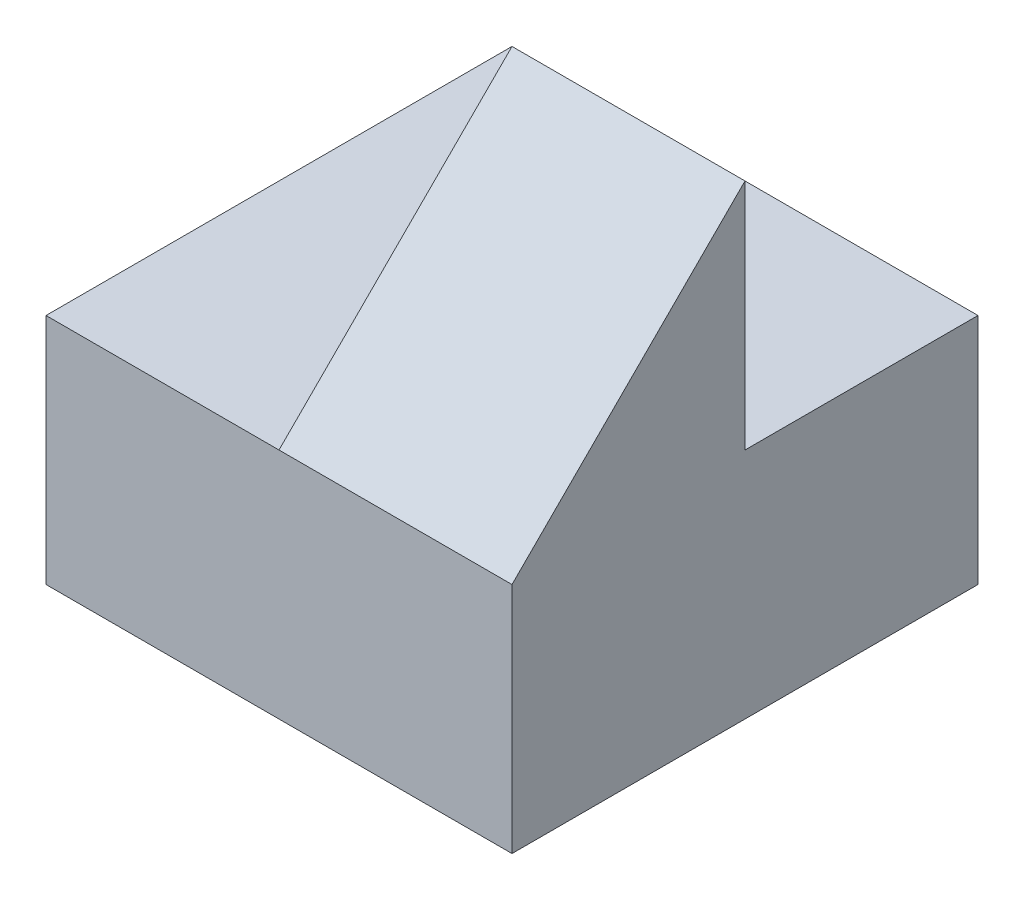
ISO-10303-21;
HEADER;
FILE_DESCRIPTION(('STEP AP214'),'2;1');
FILE_NAME('part.step','',(''),(''),'','','');
FILE_SCHEMA(('AUTOMOTIVE_DESIGN { 1 0 10303 214 1 1 1 1 }'));
ENDSEC;
DATA;
#1=APPLICATION_CONTEXT('core data for automotive mechanical design processes');
#2=APPLICATION_PROTOCOL_DEFINITION('international standard','automotive_design',2000,#1);
#3=PRODUCT_CONTEXT('',#1,'mechanical');
#4=PRODUCT('Part','Part','',(#3));
#5=PRODUCT_RELATED_PRODUCT_CATEGORY('part','',(#4));
#6=PRODUCT_DEFINITION_FORMATION('','',#4);
#7=PRODUCT_DEFINITION_CONTEXT('part definition',#1,'design');
#8=PRODUCT_DEFINITION('design','',#6,#7);
#9=PRODUCT_DEFINITION_SHAPE('','',#8);
#10=(LENGTH_UNIT() NAMED_UNIT(*) SI_UNIT(.MILLI.,.METRE.));
#11=(NAMED_UNIT(*) PLANE_ANGLE_UNIT() SI_UNIT($,.RADIAN.));
#12=(NAMED_UNIT(*) SI_UNIT($,.STERADIAN.) SOLID_ANGLE_UNIT());
#13=UNCERTAINTY_MEASURE_WITH_UNIT(LENGTH_MEASURE(1.E-05),#10,'distance_accuracy_value','');
#14=(GEOMETRIC_REPRESENTATION_CONTEXT(3) GLOBAL_UNCERTAINTY_ASSIGNED_CONTEXT((#13)) GLOBAL_UNIT_ASSIGNED_CONTEXT((#10,
#11,#12)) REPRESENTATION_CONTEXT('',''));
#15=CARTESIAN_POINT('',(0.,0.,0.));
#16=DIRECTION('',(0.,0.,1.));
#17=DIRECTION('',(1.,0.,0.));
#18=AXIS2_PLACEMENT_3D('',#15,#16,#17);
#19=CARTESIAN_POINT('',(0.,4.,0.));
#20=DIRECTION('',(1.,0.,0.));
#21=DIRECTION('',(0.,0.,-1.));
#22=AXIS2_PLACEMENT_3D('',#19,#20,#21);
#23=PLANE('',#22);
#24=DIRECTION('',(0.,0.,1.));
#25=VECTOR('',#24,1.);
#26=CARTESIAN_POINT('',(0.,2.,0.));
#27=LINE('',#26,#25);
#28=CARTESIAN_POINT('',(0.,2.,-4.));
#29=VERTEX_POINT('',#28);
#30=CARTESIAN_POINT('',(0.,2.,0.));
#31=VERTEX_POINT('',#30);
#32=EDGE_CURVE('E118',#29,#31,#27,.T.);
#33=ORIENTED_EDGE('',*,*,#32,.F.);
#34=DIRECTION('',(0.,-1.,0.));
#35=VECTOR('',#34,1.);
#36=CARTESIAN_POINT('',(0.,4.,-4.));
#37=LINE('',#36,#35);
#38=CARTESIAN_POINT('',(0.,0.,-4.));
#39=VERTEX_POINT('',#38);
#40=EDGE_CURVE('E47',#29,#39,#37,.T.);
#41=ORIENTED_EDGE('',*,*,#40,.T.);
#42=DIRECTION('',(0.,0.,1.));
#43=VECTOR('',#42,1.);
#44=CARTESIAN_POINT('',(0.,0.,0.));
#45=LINE('',#44,#43);
#46=CARTESIAN_POINT('',(0.,0.,0.));
#47=VERTEX_POINT('',#46);
#48=EDGE_CURVE('E116',#39,#47,#45,.T.);
#49=ORIENTED_EDGE('',*,*,#48,.T.);
#50=DIRECTION('',(0.,-1.,0.));
#51=VECTOR('',#50,1.);
#52=CARTESIAN_POINT('',(0.,4.,0.));
#53=LINE('',#52,#51);
#54=EDGE_CURVE('E11',#31,#47,#53,.T.);
#55=ORIENTED_EDGE('',*,*,#54,.F.);
#56=EDGE_LOOP('',(#33,#41,#49,#55));
#57=FACE_BOUND('',#56,.T.);
#58=ADVANCED_FACE('F33',(#57),#23,.F.);
#59=CARTESIAN_POINT('',(0.,4.,0.));
#60=DIRECTION('',(0.,0.,-1.));
#61=DIRECTION('',(-1.,0.,0.));
#62=AXIS2_PLACEMENT_3D('',#59,#60,#61);
#63=PLANE('',#62);
#64=DIRECTION('',(0.,-1.,0.));
#65=VECTOR('',#64,1.);
#66=CARTESIAN_POINT('',(4.,4.,0.));
#67=LINE('',#66,#65);
#68=CARTESIAN_POINT('',(4.,2.,0.));
#69=VERTEX_POINT('',#68);
#70=CARTESIAN_POINT('',(4.,0.,0.));
#71=VERTEX_POINT('',#70);
#72=EDGE_CURVE('E40',#69,#71,#67,.T.);
#73=ORIENTED_EDGE('',*,*,#72,.F.);
#74=DIRECTION('',(-1.,0.,0.));
#75=VECTOR('',#74,1.);
#76=CARTESIAN_POINT('',(10.,2.,0.));
#77=LINE('',#76,#75);
#78=CARTESIAN_POINT('',(2.,2.,0.));
#79=VERTEX_POINT('',#78);
#80=EDGE_CURVE('E107',#69,#79,#77,.T.);
#81=ORIENTED_EDGE('',*,*,#80,.T.);
#82=DIRECTION('',(1.,0.,0.));
#83=VECTOR('',#82,1.);
#84=CARTESIAN_POINT('',(0.,2.,0.));
#85=LINE('',#84,#83);
#86=EDGE_CURVE('E114',#31,#79,#85,.T.);
#87=ORIENTED_EDGE('',*,*,#86,.F.);
#88=ORIENTED_EDGE('',*,*,#54,.T.);
#89=DIRECTION('',(1.,0.,0.));
#90=VECTOR('',#89,1.);
#91=CARTESIAN_POINT('',(0.,0.,0.));
#92=LINE('',#91,#90);
#93=EDGE_CURVE('E122',#47,#71,#92,.T.);
#94=ORIENTED_EDGE('',*,*,#93,.T.);
#95=EDGE_LOOP('',(#73,#81,#87,#88,#94));
#96=FACE_BOUND('',#95,.T.);
#97=ADVANCED_FACE('F137',(#96),#63,.F.);
#98=CARTESIAN_POINT('',(0.,4.,-4.));
#99=DIRECTION('',(0.,0.,1.));
#100=DIRECTION('',(1.,0.,0.));
#101=AXIS2_PLACEMENT_3D('',#98,#99,#100);
#102=PLANE('',#101);
#103=DIRECTION('',(-1.,0.,0.));
#104=VECTOR('',#103,1.);
#105=CARTESIAN_POINT('',(0.,2.,-4.));
#106=LINE('',#105,#104);
#107=CARTESIAN_POINT('',(4.,2.,-4.));
#108=VERTEX_POINT('',#107);
#109=EDGE_CURVE('E144',#108,#29,#106,.T.);
#110=ORIENTED_EDGE('',*,*,#109,.F.);
#111=DIRECTION('',(0.,-1.,0.));
#112=VECTOR('',#111,1.);
#113=CARTESIAN_POINT('',(4.,4.,-4.));
#114=LINE('',#113,#112);
#115=CARTESIAN_POINT('',(4.,0.,-4.));
#116=VERTEX_POINT('',#115);
#117=EDGE_CURVE('E54',#108,#116,#114,.T.);
#118=ORIENTED_EDGE('',*,*,#117,.T.);
#119=DIRECTION('',(-1.,0.,0.));
#120=VECTOR('',#119,1.);
#121=CARTESIAN_POINT('',(0.,0.,-4.));
#122=LINE('',#121,#120);
#123=EDGE_CURVE('E127',#116,#39,#122,.T.);
#124=ORIENTED_EDGE('',*,*,#123,.T.);
#125=ORIENTED_EDGE('',*,*,#40,.F.);
#126=EDGE_LOOP('',(#110,#118,#124,#125));
#127=FACE_BOUND('',#126,.T.);
#128=ADVANCED_FACE('F143',(#127),#102,.F.);
#129=CARTESIAN_POINT('',(4.,4.,0.));
#130=DIRECTION('',(-1.,0.,0.));
#131=DIRECTION('',(0.,0.,1.));
#132=AXIS2_PLACEMENT_3D('',#129,#130,#131);
#133=PLANE('',#132);
#134=DIRECTION('',(0.,1.,0.));
#135=VECTOR('',#134,1.);
#136=CARTESIAN_POINT('',(4.,2.,-2.));
#137=LINE('',#136,#135);
#138=CARTESIAN_POINT('',(4.,2.,-2.));
#139=VERTEX_POINT('',#138);
#140=CARTESIAN_POINT('',(4.,4.,-2.));
#141=VERTEX_POINT('',#140);
#142=EDGE_CURVE('E113',#139,#141,#137,.T.);
#143=ORIENTED_EDGE('',*,*,#142,.T.);
#144=DIRECTION('',(0.,-0.707106781186548,0.707106781186548));
#145=VECTOR('',#144,1.);
#146=CARTESIAN_POINT('',(4.,3.,-1.));
#147=LINE('',#146,#145);
#148=EDGE_CURVE('E95',#141,#69,#147,.T.);
#149=ORIENTED_EDGE('',*,*,#148,.T.);
#150=ORIENTED_EDGE('',*,*,#72,.T.);
#151=DIRECTION('',(0.,0.,-1.));
#152=VECTOR('',#151,1.);
#153=CARTESIAN_POINT('',(4.,0.,0.));
#154=LINE('',#153,#152);
#155=EDGE_CURVE('E125',#71,#116,#154,.T.);
#156=ORIENTED_EDGE('',*,*,#155,.T.);
#157=ORIENTED_EDGE('',*,*,#117,.F.);
#158=DIRECTION('',(0.,0.,-1.));
#159=VECTOR('',#158,1.);
#160=CARTESIAN_POINT('',(4.,2.,0.));
#161=LINE('',#160,#159);
#162=EDGE_CURVE('E146',#139,#108,#161,.T.);
#163=ORIENTED_EDGE('',*,*,#162,.F.);
#164=EDGE_LOOP('',(#143,#149,#150,#156,#157,#163));
#165=FACE_BOUND('',#164,.T.);
#166=ADVANCED_FACE('F132',(#165),#133,.F.);
#167=CARTESIAN_POINT('',(0.,0.,0.));
#168=DIRECTION('',(0.,-1.,0.));
#169=DIRECTION('',(0.,0.,-1.));
#170=AXIS2_PLACEMENT_3D('',#167,#168,#169);
#171=PLANE('',#170);
#172=ORIENTED_EDGE('',*,*,#48,.F.);
#173=ORIENTED_EDGE('',*,*,#123,.F.);
#174=ORIENTED_EDGE('',*,*,#155,.F.);
#175=ORIENTED_EDGE('',*,*,#93,.F.);
#176=EDGE_LOOP('',(#172,#173,#174,#175));
#177=FACE_BOUND('',#176,.T.);
#178=ADVANCED_FACE('F142',(#177),#171,.T.);
#179=CARTESIAN_POINT('',(2.,2.,0.));
#180=DIRECTION('',(-1.,0.,0.));
#181=DIRECTION('',(0.,0.,1.));
#182=AXIS2_PLACEMENT_3D('',#179,#180,#181);
#183=PLANE('',#182);
#184=DIRECTION('',(0.,-0.707106781186548,0.707106781186548));
#185=VECTOR('',#184,1.);
#186=CARTESIAN_POINT('',(2.,2.,0.));
#187=LINE('',#186,#185);
#188=CARTESIAN_POINT('',(2.,4.,-2.));
#189=VERTEX_POINT('',#188);
#190=EDGE_CURVE('E92',#189,#79,#187,.T.);
#191=ORIENTED_EDGE('',*,*,#190,.F.);
#192=DIRECTION('',(0.,1.,0.));
#193=VECTOR('',#192,1.);
#194=CARTESIAN_POINT('',(2.,2.,-2.));
#195=LINE('',#194,#193);
#196=CARTESIAN_POINT('',(2.,2.,-2.));
#197=VERTEX_POINT('',#196);
#198=EDGE_CURVE('E104',#197,#189,#195,.T.);
#199=ORIENTED_EDGE('',*,*,#198,.F.);
#200=DIRECTION('',(0.,0.,1.));
#201=VECTOR('',#200,1.);
#202=CARTESIAN_POINT('',(2.,2.,0.));
#203=LINE('',#202,#201);
#204=EDGE_CURVE('E99',#197,#79,#203,.T.);
#205=ORIENTED_EDGE('',*,*,#204,.T.);
#206=EDGE_LOOP('',(#191,#199,#205));
#207=FACE_BOUND('',#206,.T.);
#208=ADVANCED_FACE('F103',(#207),#183,.T.);
#209=CARTESIAN_POINT('',(0.,2.,-2.));
#210=DIRECTION('',(0.,0.,1.));
#211=DIRECTION('',(1.,0.,0.));
#212=AXIS2_PLACEMENT_3D('',#209,#210,#211);
#213=PLANE('',#212);
#214=DIRECTION('',(1.,0.,0.));
#215=VECTOR('',#214,1.);
#216=CARTESIAN_POINT('',(0.,4.,-2.));
#217=LINE('',#216,#215);
#218=EDGE_CURVE('E89',#189,#141,#217,.T.);
#219=ORIENTED_EDGE('',*,*,#218,.T.);
#220=ORIENTED_EDGE('',*,*,#142,.F.);
#221=DIRECTION('',(1.,0.,0.));
#222=VECTOR('',#221,1.);
#223=CARTESIAN_POINT('',(0.,2.,-2.));
#224=LINE('',#223,#222);
#225=EDGE_CURVE('E112',#197,#139,#224,.T.);
#226=ORIENTED_EDGE('',*,*,#225,.F.);
#227=ORIENTED_EDGE('',*,*,#198,.T.);
#228=EDGE_LOOP('',(#219,#220,#226,#227));
#229=FACE_BOUND('',#228,.T.);
#230=ADVANCED_FACE('F110',(#229),#213,.F.);
#231=CARTESIAN_POINT('',(0.,2.,0.));
#232=DIRECTION('',(0.,1.,0.));
#233=DIRECTION('',(0.,0.,1.));
#234=AXIS2_PLACEMENT_3D('',#231,#232,#233);
#235=PLANE('',#234);
#236=ORIENTED_EDGE('',*,*,#204,.F.);
#237=ORIENTED_EDGE('',*,*,#225,.T.);
#238=ORIENTED_EDGE('',*,*,#162,.T.);
#239=ORIENTED_EDGE('',*,*,#109,.T.);
#240=ORIENTED_EDGE('',*,*,#32,.T.);
#241=ORIENTED_EDGE('',*,*,#86,.T.);
#242=EDGE_LOOP('',(#236,#237,#238,#239,#240,#241));
#243=FACE_BOUND('',#242,.T.);
#244=ADVANCED_FACE('F153',(#243),#235,.T.);
#245=CARTESIAN_POINT('',(10.,1.,1.));
#246=DIRECTION('',(0.,-0.707106781186548,-0.707106781186548));
#247=DIRECTION('',(0.,0.707106781186548,-0.707106781186548));
#248=AXIS2_PLACEMENT_3D('',#245,#246,#247);
#249=PLANE('',#248);
#250=ORIENTED_EDGE('',*,*,#218,.F.);
#251=ORIENTED_EDGE('',*,*,#190,.T.);
#252=ORIENTED_EDGE('',*,*,#80,.F.);
#253=ORIENTED_EDGE('',*,*,#148,.F.);
#254=EDGE_LOOP('',(#250,#251,#252,#253));
#255=FACE_BOUND('',#254,.T.);
#256=ADVANCED_FACE('F91',(#255),#249,.F.);
#257=CLOSED_SHELL('',(#58,#97,#128,#166,#178,#208,#230,#244,#256));
#258=MANIFOLD_SOLID_BREP('B2',#257);
#259=ADVANCED_BREP_SHAPE_REPRESENTATION('',(#18,#258),#14);
#260=SHAPE_DEFINITION_REPRESENTATION(#9,#259);
ENDSEC;
END-ISO-10303-21;
